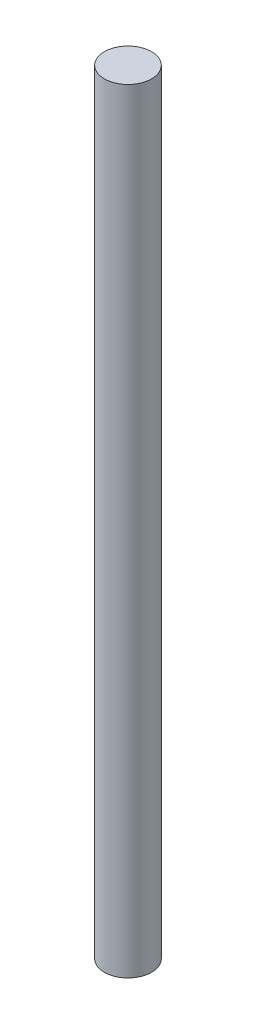
ISO-10303-21;
HEADER;
FILE_DESCRIPTION(('STEP AP214'),'2;1');
FILE_NAME('part.step','',(''),(''),'','','');
FILE_SCHEMA(('AUTOMOTIVE_DESIGN { 1 0 10303 214 1 1 1 1 }'));
ENDSEC;
DATA;
#1=APPLICATION_CONTEXT('core data for automotive mechanical design processes');
#2=APPLICATION_PROTOCOL_DEFINITION('international standard','automotive_design',2000,#1);
#3=PRODUCT_CONTEXT('',#1,'mechanical');
#4=PRODUCT('Part','Part','',(#3));
#5=PRODUCT_RELATED_PRODUCT_CATEGORY('part','',(#4));
#6=PRODUCT_DEFINITION_FORMATION('','',#4);
#7=PRODUCT_DEFINITION_CONTEXT('part definition',#1,'design');
#8=PRODUCT_DEFINITION('design','',#6,#7);
#9=PRODUCT_DEFINITION_SHAPE('','',#8);
#10=(LENGTH_UNIT() NAMED_UNIT(*) SI_UNIT(.MILLI.,.METRE.));
#11=(NAMED_UNIT(*) PLANE_ANGLE_UNIT() SI_UNIT($,.RADIAN.));
#12=(NAMED_UNIT(*) SI_UNIT($,.STERADIAN.) SOLID_ANGLE_UNIT());
#13=UNCERTAINTY_MEASURE_WITH_UNIT(LENGTH_MEASURE(1.E-05),#10,'distance_accuracy_value','');
#14=(GEOMETRIC_REPRESENTATION_CONTEXT(3) GLOBAL_UNCERTAINTY_ASSIGNED_CONTEXT((#13)) GLOBAL_UNIT_ASSIGNED_CONTEXT((#10,
#11,#12)) REPRESENTATION_CONTEXT('',''));
#15=CARTESIAN_POINT('',(0.,0.,0.));
#16=DIRECTION('',(0.,0.,1.));
#17=DIRECTION('',(1.,0.,0.));
#18=AXIS2_PLACEMENT_3D('',#15,#16,#17);
#19=CARTESIAN_POINT('',(0.,5000.,0.));
#20=DIRECTION('',(0.,-1.,0.));
#21=DIRECTION('',(0.,0.,-1.));
#22=AXIS2_PLACEMENT_3D('',#19,#20,#21);
#23=CYLINDRICAL_SURFACE('',#22,152.4);
#24=CARTESIAN_POINT('',(0.,5000.,0.));
#25=DIRECTION('',(0.,1.,0.));
#26=DIRECTION('',(0.,0.,1.));
#27=AXIS2_PLACEMENT_3D('',#24,#25,#26);
#28=CIRCLE('',#27,152.4);
#29=CARTESIAN_POINT('',(0.,5000.,152.4));
#30=VERTEX_POINT('',#29);
#31=EDGE_CURVE('E10',#30,#30,#28,.T.);
#32=ORIENTED_EDGE('',*,*,#31,.F.);
#33=EDGE_LOOP('',(#32));
#34=FACE_BOUND('',#33,.T.);
#35=CARTESIAN_POINT('',(0.,0.,0.));
#36=DIRECTION('',(0.,1.,0.));
#37=DIRECTION('',(0.,0.,1.));
#38=AXIS2_PLACEMENT_3D('',#35,#36,#37);
#39=CIRCLE('',#38,152.4);
#40=CARTESIAN_POINT('',(0.,0.,152.4));
#41=VERTEX_POINT('',#40);
#42=EDGE_CURVE('E38',#41,#41,#39,.T.);
#43=ORIENTED_EDGE('',*,*,#42,.T.);
#44=EDGE_LOOP('',(#43));
#45=FACE_BOUND('',#44,.T.);
#46=ADVANCED_FACE('F35',(#34,#45),#23,.T.);
#47=CARTESIAN_POINT('',(0.,5000.,0.));
#48=DIRECTION('',(0.,1.,0.));
#49=DIRECTION('',(0.,0.,1.));
#50=AXIS2_PLACEMENT_3D('',#47,#48,#49);
#51=PLANE('',#50);
#52=ORIENTED_EDGE('',*,*,#31,.T.);
#53=EDGE_LOOP('',(#52));
#54=FACE_BOUND('',#53,.T.);
#55=ADVANCED_FACE('F50',(#54),#51,.T.);
#56=CARTESIAN_POINT('',(0.,0.,0.));
#57=DIRECTION('',(0.,1.,0.));
#58=DIRECTION('',(0.,0.,1.));
#59=AXIS2_PLACEMENT_3D('',#56,#57,#58);
#60=PLANE('',#59);
#61=ORIENTED_EDGE('',*,*,#42,.F.);
#62=EDGE_LOOP('',(#61));
#63=FACE_BOUND('',#62,.T.);
#64=ADVANCED_FACE('F48',(#63),#60,.F.);
#65=CLOSED_SHELL('',(#46,#55,#64));
#66=MANIFOLD_SOLID_BREP('B2',#65);
#67=ADVANCED_BREP_SHAPE_REPRESENTATION('',(#18,#66),#14);
#68=SHAPE_DEFINITION_REPRESENTATION(#9,#67);
ENDSEC;
END-ISO-10303-21;
